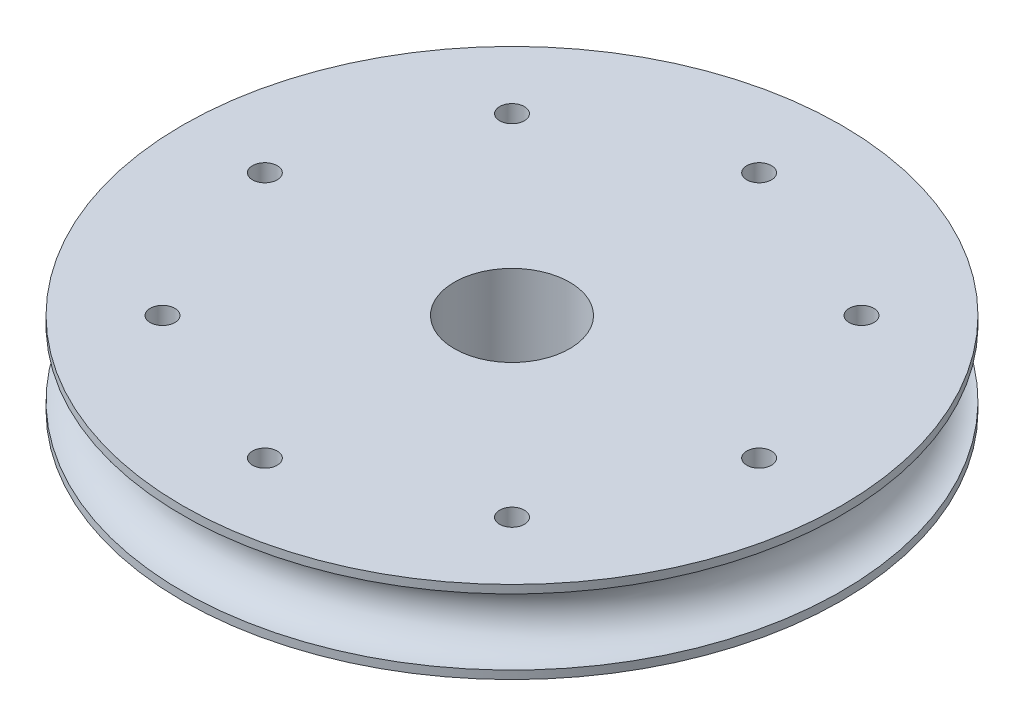
ISO-10303-21;
HEADER;
FILE_DESCRIPTION(('STEP AP214'),'2;1');
FILE_NAME('part.step','',(''),(''),'','','');
FILE_SCHEMA(('AUTOMOTIVE_DESIGN { 1 0 10303 214 1 1 1 1 }'));
ENDSEC;
DATA;
#1=APPLICATION_CONTEXT('core data for automotive mechanical design processes');
#2=APPLICATION_PROTOCOL_DEFINITION('international standard','automotive_design',2000,#1);
#3=PRODUCT_CONTEXT('',#1,'mechanical');
#4=PRODUCT('Part','Part','',(#3));
#5=PRODUCT_RELATED_PRODUCT_CATEGORY('part','',(#4));
#6=PRODUCT_DEFINITION_FORMATION('','',#4);
#7=PRODUCT_DEFINITION_CONTEXT('part definition',#1,'design');
#8=PRODUCT_DEFINITION('design','',#6,#7);
#9=PRODUCT_DEFINITION_SHAPE('','',#8);
#10=(LENGTH_UNIT() NAMED_UNIT(*) SI_UNIT(.MILLI.,.METRE.));
#11=(NAMED_UNIT(*) PLANE_ANGLE_UNIT() SI_UNIT($,.RADIAN.));
#12=(NAMED_UNIT(*) SI_UNIT($,.STERADIAN.) SOLID_ANGLE_UNIT());
#13=UNCERTAINTY_MEASURE_WITH_UNIT(LENGTH_MEASURE(1.E-05),#10,'distance_accuracy_value','');
#14=(GEOMETRIC_REPRESENTATION_CONTEXT(3) GLOBAL_UNCERTAINTY_ASSIGNED_CONTEXT((#13)) GLOBAL_UNIT_ASSIGNED_CONTEXT((#10,
#11,#12)) REPRESENTATION_CONTEXT('',''));
#15=CARTESIAN_POINT('',(0.,0.,0.));
#16=DIRECTION('',(0.,0.,1.));
#17=DIRECTION('',(1.,0.,0.));
#18=AXIS2_PLACEMENT_3D('',#15,#16,#17);
#19=CARTESIAN_POINT('',(0.,5.,0.));
#20=DIRECTION('',(0.,-1.,0.));
#21=DIRECTION('',(0.,0.,-1.));
#22=AXIS2_PLACEMENT_3D('',#19,#20,#21);
#23=CYLINDRICAL_SURFACE('',#22,20.);
#24=CARTESIAN_POINT('',(0.,0.,0.));
#25=DIRECTION('',(0.,1.,0.));
#26=DIRECTION('',(0.,0.,1.));
#27=AXIS2_PLACEMENT_3D('',#24,#25,#26);
#28=CIRCLE('',#27,20.);
#29=CARTESIAN_POINT('',(0.,0.,20.));
#30=VERTEX_POINT('',#29);
#31=EDGE_CURVE('E34',#30,#30,#28,.T.);
#32=ORIENTED_EDGE('',*,*,#31,.T.);
#33=EDGE_LOOP('',(#32));
#34=FACE_BOUND('',#33,.T.);
#35=CARTESIAN_POINT('',(0.,0.5,0.));
#36=DIRECTION('',(0.,-1.,0.));
#37=DIRECTION('',(0.,0.,-1.));
#38=AXIS2_PLACEMENT_3D('',#35,#36,#37);
#39=CIRCLE('',#38,20.);
#40=CARTESIAN_POINT('',(0.,0.5,-20.));
#41=VERTEX_POINT('',#40);
#42=EDGE_CURVE('E51',#41,#41,#39,.T.);
#43=ORIENTED_EDGE('',*,*,#42,.T.);
#44=EDGE_LOOP('',(#43));
#45=FACE_BOUND('',#44,.T.);
#46=ADVANCED_FACE('F31',(#34,#45),#23,.T.);
#47=CARTESIAN_POINT('',(0.,5.,0.));
#48=DIRECTION('',(0.,1.,0.));
#49=DIRECTION('',(0.,0.,1.));
#50=AXIS2_PLACEMENT_3D('',#47,#48,#49);
#51=CIRCLE('',#50,20.);
#52=CARTESIAN_POINT('',(0.,5.,20.));
#53=VERTEX_POINT('',#52);
#54=EDGE_CURVE('E10',#53,#53,#51,.T.);
#55=ORIENTED_EDGE('',*,*,#54,.F.);
#56=EDGE_LOOP('',(#55));
#57=FACE_BOUND('',#56,.T.);
#58=CARTESIAN_POINT('',(0.,4.5,0.));
#59=DIRECTION('',(0.,-1.,0.));
#60=DIRECTION('',(0.,0.,-1.));
#61=AXIS2_PLACEMENT_3D('',#58,#59,#60);
#62=CIRCLE('',#61,20.);
#63=CARTESIAN_POINT('',(0.,4.5,-20.));
#64=VERTEX_POINT('',#63);
#65=EDGE_CURVE('E46',#64,#64,#62,.T.);
#66=ORIENTED_EDGE('',*,*,#65,.F.);
#67=EDGE_LOOP('',(#66));
#68=FACE_BOUND('',#67,.T.);
#69=ADVANCED_FACE('F110',(#57,#68),#23,.T.);
#70=CARTESIAN_POINT('',(0.,5.,0.));
#71=DIRECTION('',(0.,1.,0.));
#72=DIRECTION('',(0.,0.,1.));
#73=AXIS2_PLACEMENT_3D('',#70,#71,#72);
#74=PLANE('',#73);
#75=CARTESIAN_POINT('',(0.,5.,15.));
#76=DIRECTION('',(0.,1.,0.));
#77=DIRECTION('',(0.,0.,1.));
#78=AXIS2_PLACEMENT_3D('',#75,#76,#77);
#79=CIRCLE('',#78,0.75);
#80=CARTESIAN_POINT('',(0.,5.,15.75));
#81=VERTEX_POINT('',#80);
#82=EDGE_CURVE('E54',#81,#81,#79,.T.);
#83=ORIENTED_EDGE('',*,*,#82,.F.);
#84=EDGE_LOOP('',(#83));
#85=FACE_BOUND('',#84,.T.);
#86=CARTESIAN_POINT('',(-10.6066017177982,5.,10.6066017177982));
#87=DIRECTION('',(0.,1.,0.));
#88=DIRECTION('',(0.,0.,1.));
#89=AXIS2_PLACEMENT_3D('',#86,#87,#88);
#90=CIRCLE('',#89,0.75);
#91=CARTESIAN_POINT('',(-10.6066017177982,5.,11.3566017177982));
#92=VERTEX_POINT('',#91);
#93=EDGE_CURVE('E94',#92,#92,#90,.T.);
#94=ORIENTED_EDGE('',*,*,#93,.F.);
#95=EDGE_LOOP('',(#94));
#96=FACE_BOUND('',#95,.T.);
#97=CARTESIAN_POINT('',(-15.,5.,0.));
#98=DIRECTION('',(0.,1.,0.));
#99=DIRECTION('',(0.,0.,1.));
#100=AXIS2_PLACEMENT_3D('',#97,#98,#99);
#101=CIRCLE('',#100,0.75);
#102=CARTESIAN_POINT('',(-15.,5.,0.749999999999948));
#103=VERTEX_POINT('',#102);
#104=EDGE_CURVE('E88',#103,#103,#101,.T.);
#105=ORIENTED_EDGE('',*,*,#104,.F.);
#106=EDGE_LOOP('',(#105));
#107=FACE_BOUND('',#106,.T.);
#108=CARTESIAN_POINT('',(-10.6066017177982,5.,-10.6066017177983));
#109=DIRECTION('',(0.,1.,0.));
#110=DIRECTION('',(0.,0.,1.));
#111=AXIS2_PLACEMENT_3D('',#108,#109,#110);
#112=CIRCLE('',#111,0.75);
#113=CARTESIAN_POINT('',(-10.6066017177982,5.,-9.85660171779827));
#114=VERTEX_POINT('',#113);
#115=EDGE_CURVE('E82',#114,#114,#112,.T.);
#116=ORIENTED_EDGE('',*,*,#115,.F.);
#117=EDGE_LOOP('',(#116));
#118=FACE_BOUND('',#117,.T.);
#119=CARTESIAN_POINT('',(1.04744440165294E-13,5.,-15.));
#120=DIRECTION('',(0.,1.,0.));
#121=DIRECTION('',(0.,0.,1.));
#122=AXIS2_PLACEMENT_3D('',#119,#120,#121);
#123=CIRCLE('',#122,0.75);
#124=CARTESIAN_POINT('',(1.04744440165294E-13,5.,-14.25));
#125=VERTEX_POINT('',#124);
#126=EDGE_CURVE('E76',#125,#125,#123,.T.);
#127=ORIENTED_EDGE('',*,*,#126,.F.);
#128=EDGE_LOOP('',(#127));
#129=FACE_BOUND('',#128,.T.);
#130=CARTESIAN_POINT('',(10.6066017177983,5.,-10.6066017177981));
#131=DIRECTION('',(0.,1.,0.));
#132=DIRECTION('',(0.,0.,1.));
#133=AXIS2_PLACEMENT_3D('',#130,#131,#132);
#134=CIRCLE('',#133,0.75);
#135=CARTESIAN_POINT('',(10.6066017177983,5.,-9.85660171779812));
#136=VERTEX_POINT('',#135);
#137=EDGE_CURVE('E70',#136,#136,#134,.T.);
#138=ORIENTED_EDGE('',*,*,#137,.F.);
#139=EDGE_LOOP('',(#138));
#140=FACE_BOUND('',#139,.T.);
#141=CARTESIAN_POINT('',(15.,5.,1.57116660247941E-13));
#142=DIRECTION('',(0.,1.,0.));
#143=DIRECTION('',(0.,0.,1.));
#144=AXIS2_PLACEMENT_3D('',#141,#142,#143);
#145=CIRCLE('',#144,0.75);
#146=CARTESIAN_POINT('',(15.,5.,0.750000000000157));
#147=VERTEX_POINT('',#146);
#148=EDGE_CURVE('E64',#147,#147,#145,.T.);
#149=ORIENTED_EDGE('',*,*,#148,.F.);
#150=EDGE_LOOP('',(#149));
#151=FACE_BOUND('',#150,.T.);
#152=CARTESIAN_POINT('',(10.6066017177981,5.,10.6066017177983));
#153=DIRECTION('',(0.,1.,0.));
#154=DIRECTION('',(0.,0.,1.));
#155=AXIS2_PLACEMENT_3D('',#152,#153,#154);
#156=CIRCLE('',#155,0.75);
#157=CARTESIAN_POINT('',(10.6066017177981,5.,11.3566017177983));
#158=VERTEX_POINT('',#157);
#159=EDGE_CURVE('E58',#158,#158,#156,.T.);
#160=ORIENTED_EDGE('',*,*,#159,.F.);
#161=EDGE_LOOP('',(#160));
#162=FACE_BOUND('',#161,.T.);
#163=ORIENTED_EDGE('',*,*,#54,.T.);
#164=EDGE_LOOP('',(#163));
#165=FACE_BOUND('',#164,.T.);
#166=CARTESIAN_POINT('',(0.,5.,0.));
#167=DIRECTION('',(0.,1.,0.));
#168=DIRECTION('',(0.,0.,1.));
#169=AXIS2_PLACEMENT_3D('',#166,#167,#168);
#170=CIRCLE('',#169,3.5);
#171=CARTESIAN_POINT('',(0.,5.,3.5));
#172=VERTEX_POINT('',#171);
#173=EDGE_CURVE('E41',#172,#172,#170,.T.);
#174=ORIENTED_EDGE('',*,*,#173,.F.);
#175=EDGE_LOOP('',(#174));
#176=FACE_BOUND('',#175,.T.);
#177=ADVANCED_FACE('F106',(#85,#96,#107,#118,#129,#140,#151,#162,#165,#176),#74,.T.);
#178=CARTESIAN_POINT('',(0.,0.,0.));
#179=DIRECTION('',(0.,1.,0.));
#180=DIRECTION('',(0.,0.,1.));
#181=AXIS2_PLACEMENT_3D('',#178,#179,#180);
#182=PLANE('',#181);
#183=CARTESIAN_POINT('',(0.,0.,15.));
#184=DIRECTION('',(0.,1.,0.));
#185=DIRECTION('',(0.,0.,1.));
#186=AXIS2_PLACEMENT_3D('',#183,#184,#185);
#187=CIRCLE('',#186,0.75);
#188=CARTESIAN_POINT('',(0.,0.,15.75));
#189=VERTEX_POINT('',#188);
#190=EDGE_CURVE('E97',#189,#189,#187,.T.);
#191=ORIENTED_EDGE('',*,*,#190,.T.);
#192=EDGE_LOOP('',(#191));
#193=FACE_BOUND('',#192,.T.);
#194=CARTESIAN_POINT('',(-10.6066017177982,0.,10.6066017177982));
#195=DIRECTION('',(0.,1.,0.));
#196=DIRECTION('',(0.,0.,1.));
#197=AXIS2_PLACEMENT_3D('',#194,#195,#196);
#198=CIRCLE('',#197,0.75);
#199=CARTESIAN_POINT('',(-10.6066017177982,0.,11.3566017177982));
#200=VERTEX_POINT('',#199);
#201=EDGE_CURVE('E91',#200,#200,#198,.T.);
#202=ORIENTED_EDGE('',*,*,#201,.T.);
#203=EDGE_LOOP('',(#202));
#204=FACE_BOUND('',#203,.T.);
#205=CARTESIAN_POINT('',(-15.,0.,0.));
#206=DIRECTION('',(0.,1.,0.));
#207=DIRECTION('',(0.,0.,1.));
#208=AXIS2_PLACEMENT_3D('',#205,#206,#207);
#209=CIRCLE('',#208,0.75);
#210=CARTESIAN_POINT('',(-15.,0.,0.749999999999948));
#211=VERTEX_POINT('',#210);
#212=EDGE_CURVE('E85',#211,#211,#209,.T.);
#213=ORIENTED_EDGE('',*,*,#212,.T.);
#214=EDGE_LOOP('',(#213));
#215=FACE_BOUND('',#214,.T.);
#216=CARTESIAN_POINT('',(-10.6066017177982,0.,-10.6066017177983));
#217=DIRECTION('',(0.,1.,0.));
#218=DIRECTION('',(0.,0.,1.));
#219=AXIS2_PLACEMENT_3D('',#216,#217,#218);
#220=CIRCLE('',#219,0.75);
#221=CARTESIAN_POINT('',(-10.6066017177982,0.,-9.85660171779827));
#222=VERTEX_POINT('',#221);
#223=EDGE_CURVE('E79',#222,#222,#220,.T.);
#224=ORIENTED_EDGE('',*,*,#223,.T.);
#225=EDGE_LOOP('',(#224));
#226=FACE_BOUND('',#225,.T.);
#227=CARTESIAN_POINT('',(1.04744440165294E-13,0.,-15.));
#228=DIRECTION('',(0.,1.,0.));
#229=DIRECTION('',(0.,0.,1.));
#230=AXIS2_PLACEMENT_3D('',#227,#228,#229);
#231=CIRCLE('',#230,0.75);
#232=CARTESIAN_POINT('',(1.04744440165294E-13,0.,-14.25));
#233=VERTEX_POINT('',#232);
#234=EDGE_CURVE('E73',#233,#233,#231,.T.);
#235=ORIENTED_EDGE('',*,*,#234,.T.);
#236=EDGE_LOOP('',(#235));
#237=FACE_BOUND('',#236,.T.);
#238=CARTESIAN_POINT('',(10.6066017177983,0.,-10.6066017177981));
#239=DIRECTION('',(0.,1.,0.));
#240=DIRECTION('',(0.,0.,1.));
#241=AXIS2_PLACEMENT_3D('',#238,#239,#240);
#242=CIRCLE('',#241,0.75);
#243=CARTESIAN_POINT('',(10.6066017177983,0.,-9.85660171779812));
#244=VERTEX_POINT('',#243);
#245=EDGE_CURVE('E67',#244,#244,#242,.T.);
#246=ORIENTED_EDGE('',*,*,#245,.T.);
#247=EDGE_LOOP('',(#246));
#248=FACE_BOUND('',#247,.T.);
#249=CARTESIAN_POINT('',(15.,0.,1.57116660247941E-13));
#250=DIRECTION('',(0.,1.,0.));
#251=DIRECTION('',(0.,0.,1.));
#252=AXIS2_PLACEMENT_3D('',#249,#250,#251);
#253=CIRCLE('',#252,0.75);
#254=CARTESIAN_POINT('',(15.,0.,0.750000000000157));
#255=VERTEX_POINT('',#254);
#256=EDGE_CURVE('E61',#255,#255,#253,.T.);
#257=ORIENTED_EDGE('',*,*,#256,.T.);
#258=EDGE_LOOP('',(#257));
#259=FACE_BOUND('',#258,.T.);
#260=CARTESIAN_POINT('',(10.6066017177981,0.,10.6066017177983));
#261=DIRECTION('',(0.,1.,0.));
#262=DIRECTION('',(0.,0.,1.));
#263=AXIS2_PLACEMENT_3D('',#260,#261,#262);
#264=CIRCLE('',#263,0.75);
#265=CARTESIAN_POINT('',(10.6066017177981,0.,11.3566017177983));
#266=VERTEX_POINT('',#265);
#267=EDGE_CURVE('E55',#266,#266,#264,.T.);
#268=ORIENTED_EDGE('',*,*,#267,.T.);
#269=EDGE_LOOP('',(#268));
#270=FACE_BOUND('',#269,.T.);
#271=ORIENTED_EDGE('',*,*,#31,.F.);
#272=EDGE_LOOP('',(#271));
#273=FACE_BOUND('',#272,.T.);
#274=CARTESIAN_POINT('',(0.,0.,0.));
#275=DIRECTION('',(0.,1.,0.));
#276=DIRECTION('',(0.,0.,1.));
#277=AXIS2_PLACEMENT_3D('',#274,#275,#276);
#278=CIRCLE('',#277,3.5);
#279=CARTESIAN_POINT('',(0.,0.,3.5));
#280=VERTEX_POINT('',#279);
#281=EDGE_CURVE('E43',#280,#280,#278,.T.);
#282=ORIENTED_EDGE('',*,*,#281,.T.);
#283=EDGE_LOOP('',(#282));
#284=FACE_BOUND('',#283,.T.);
#285=ADVANCED_FACE('F109',(#193,#204,#215,#226,#237,#248,#259,#270,#273,#284),#182,.F.);
#286=CARTESIAN_POINT('',(0.,5.,0.));
#287=DIRECTION('',(0.,-1.,0.));
#288=DIRECTION('',(0.,0.,-1.));
#289=AXIS2_PLACEMENT_3D('',#286,#287,#288);
#290=CYLINDRICAL_SURFACE('',#289,3.5);
#291=ORIENTED_EDGE('',*,*,#173,.T.);
#292=EDGE_LOOP('',(#291));
#293=FACE_BOUND('',#292,.T.);
#294=ORIENTED_EDGE('',*,*,#281,.F.);
#295=EDGE_LOOP('',(#294));
#296=FACE_BOUND('',#295,.T.);
#297=ADVANCED_FACE('F128',(#293,#296),#290,.F.);
#298=CARTESIAN_POINT('',(0.,2.5,0.));
#299=DIRECTION('',(0.,-1.,0.));
#300=DIRECTION('',(0.,0.,-1.));
#301=AXIS2_PLACEMENT_3D('',#298,#299,#300);
#302=TOROIDAL_SURFACE('',#301,20.,2.);
#303=ORIENTED_EDGE('',*,*,#65,.T.);
#304=EDGE_LOOP('',(#303));
#305=FACE_BOUND('',#304,.T.);
#306=ORIENTED_EDGE('',*,*,#42,.F.);
#307=EDGE_LOOP('',(#306));
#308=FACE_BOUND('',#307,.T.);
#309=ADVANCED_FACE('F131',(#305,#308),#302,.F.);
#310=CARTESIAN_POINT('',(10.6066017177981,5.,10.6066017177983));
#311=DIRECTION('',(0.,-1.,0.));
#312=DIRECTION('',(0.,0.,-1.));
#313=AXIS2_PLACEMENT_3D('',#310,#311,#312);
#314=CYLINDRICAL_SURFACE('',#313,0.75);
#315=ORIENTED_EDGE('',*,*,#159,.T.);
#316=EDGE_LOOP('',(#315));
#317=FACE_BOUND('',#316,.T.);
#318=ORIENTED_EDGE('',*,*,#267,.F.);
#319=EDGE_LOOP('',(#318));
#320=FACE_BOUND('',#319,.T.);
#321=ADVANCED_FACE('F151',(#317,#320),#314,.F.);
#322=CARTESIAN_POINT('',(15.,5.,1.57116660247941E-13));
#323=DIRECTION('',(0.,-1.,0.));
#324=DIRECTION('',(0.,0.,-1.));
#325=AXIS2_PLACEMENT_3D('',#322,#323,#324);
#326=CYLINDRICAL_SURFACE('',#325,0.75);
#327=ORIENTED_EDGE('',*,*,#148,.T.);
#328=EDGE_LOOP('',(#327));
#329=FACE_BOUND('',#328,.T.);
#330=ORIENTED_EDGE('',*,*,#256,.F.);
#331=EDGE_LOOP('',(#330));
#332=FACE_BOUND('',#331,.T.);
#333=ADVANCED_FACE('F157',(#329,#332),#326,.F.);
#334=CARTESIAN_POINT('',(10.6066017177983,5.,-10.6066017177981));
#335=DIRECTION('',(0.,-1.,0.));
#336=DIRECTION('',(0.,0.,-1.));
#337=AXIS2_PLACEMENT_3D('',#334,#335,#336);
#338=CYLINDRICAL_SURFACE('',#337,0.75);
#339=ORIENTED_EDGE('',*,*,#137,.T.);
#340=EDGE_LOOP('',(#339));
#341=FACE_BOUND('',#340,.T.);
#342=ORIENTED_EDGE('',*,*,#245,.F.);
#343=EDGE_LOOP('',(#342));
#344=FACE_BOUND('',#343,.T.);
#345=ADVANCED_FACE('F163',(#341,#344),#338,.F.);
#346=CARTESIAN_POINT('',(1.04744440165294E-13,5.,-15.));
#347=DIRECTION('',(0.,-1.,0.));
#348=DIRECTION('',(0.,0.,-1.));
#349=AXIS2_PLACEMENT_3D('',#346,#347,#348);
#350=CYLINDRICAL_SURFACE('',#349,0.75);
#351=ORIENTED_EDGE('',*,*,#126,.T.);
#352=EDGE_LOOP('',(#351));
#353=FACE_BOUND('',#352,.T.);
#354=ORIENTED_EDGE('',*,*,#234,.F.);
#355=EDGE_LOOP('',(#354));
#356=FACE_BOUND('',#355,.T.);
#357=ADVANCED_FACE('F167',(#353,#356),#350,.F.);
#358=CARTESIAN_POINT('',(-10.6066017177982,5.,-10.6066017177983));
#359=DIRECTION('',(0.,-1.,0.));
#360=DIRECTION('',(0.,0.,-1.));
#361=AXIS2_PLACEMENT_3D('',#358,#359,#360);
#362=CYLINDRICAL_SURFACE('',#361,0.75);
#363=ORIENTED_EDGE('',*,*,#115,.T.);
#364=EDGE_LOOP('',(#363));
#365=FACE_BOUND('',#364,.T.);
#366=ORIENTED_EDGE('',*,*,#223,.F.);
#367=EDGE_LOOP('',(#366));
#368=FACE_BOUND('',#367,.T.);
#369=ADVANCED_FACE('F171',(#365,#368),#362,.F.);
#370=CARTESIAN_POINT('',(-15.,5.,0.));
#371=DIRECTION('',(0.,-1.,0.));
#372=DIRECTION('',(0.,0.,-1.));
#373=AXIS2_PLACEMENT_3D('',#370,#371,#372);
#374=CYLINDRICAL_SURFACE('',#373,0.75);
#375=ORIENTED_EDGE('',*,*,#104,.T.);
#376=EDGE_LOOP('',(#375));
#377=FACE_BOUND('',#376,.T.);
#378=ORIENTED_EDGE('',*,*,#212,.F.);
#379=EDGE_LOOP('',(#378));
#380=FACE_BOUND('',#379,.T.);
#381=ADVANCED_FACE('F175',(#377,#380),#374,.F.);
#382=CARTESIAN_POINT('',(-10.6066017177982,5.,10.6066017177982));
#383=DIRECTION('',(0.,-1.,0.));
#384=DIRECTION('',(0.,0.,-1.));
#385=AXIS2_PLACEMENT_3D('',#382,#383,#384);
#386=CYLINDRICAL_SURFACE('',#385,0.75);
#387=ORIENTED_EDGE('',*,*,#93,.T.);
#388=EDGE_LOOP('',(#387));
#389=FACE_BOUND('',#388,.T.);
#390=ORIENTED_EDGE('',*,*,#201,.F.);
#391=EDGE_LOOP('',(#390));
#392=FACE_BOUND('',#391,.T.);
#393=ADVANCED_FACE('F179',(#389,#392),#386,.F.);
#394=CARTESIAN_POINT('',(0.,5.,15.));
#395=DIRECTION('',(0.,-1.,0.));
#396=DIRECTION('',(0.,0.,-1.));
#397=AXIS2_PLACEMENT_3D('',#394,#395,#396);
#398=CYLINDRICAL_SURFACE('',#397,0.75);
#399=ORIENTED_EDGE('',*,*,#82,.T.);
#400=EDGE_LOOP('',(#399));
#401=FACE_BOUND('',#400,.T.);
#402=ORIENTED_EDGE('',*,*,#190,.F.);
#403=EDGE_LOOP('',(#402));
#404=FACE_BOUND('',#403,.T.);
#405=ADVANCED_FACE('F103',(#401,#404),#398,.F.);
#406=CLOSED_SHELL('',(#46,#69,#177,#285,#297,#309,#321,#333,#345,#357,#369,#381,#393,#405));
#407=MANIFOLD_SOLID_BREP('B2',#406);
#408=ADVANCED_BREP_SHAPE_REPRESENTATION('',(#18,#407),#14);
#409=SHAPE_DEFINITION_REPRESENTATION(#9,#408);
ENDSEC;
END-ISO-10303-21;
